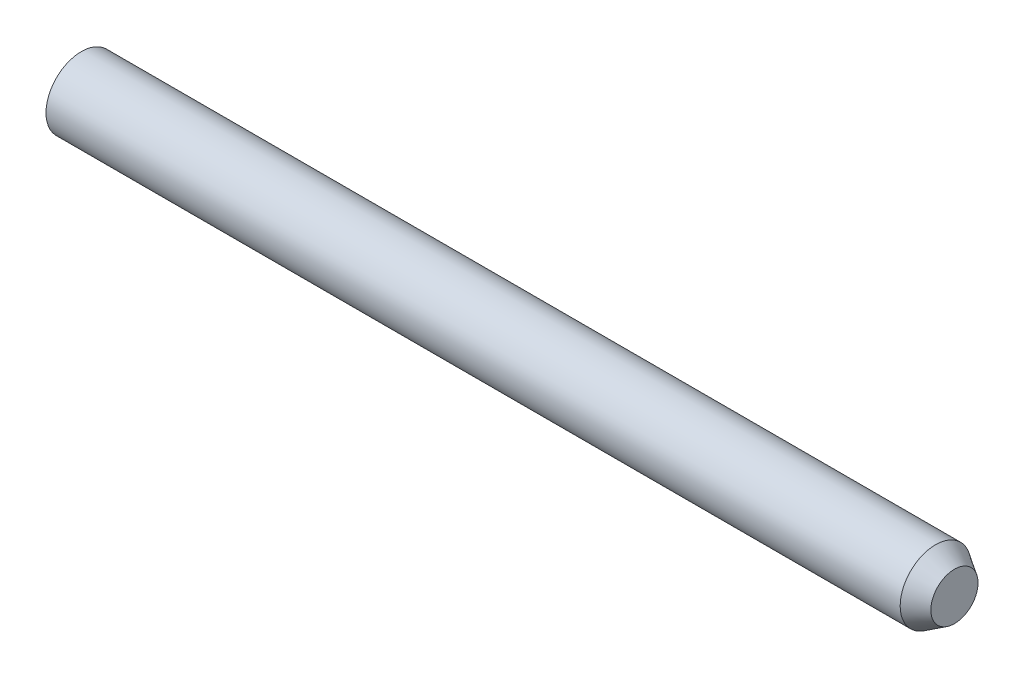
ISO-10303-21;
HEADER;
FILE_DESCRIPTION(('STEP AP214'),'2;1');
FILE_NAME('part.step','',(''),(''),'','','');
FILE_SCHEMA(('AUTOMOTIVE_DESIGN { 1 0 10303 214 1 1 1 1 }'));
ENDSEC;
DATA;
#1=APPLICATION_CONTEXT('core data for automotive mechanical design processes');
#2=APPLICATION_PROTOCOL_DEFINITION('international standard','automotive_design',2000,#1);
#3=PRODUCT_CONTEXT('',#1,'mechanical');
#4=PRODUCT('Part','Part','',(#3));
#5=PRODUCT_RELATED_PRODUCT_CATEGORY('part','',(#4));
#6=PRODUCT_DEFINITION_FORMATION('','',#4);
#7=PRODUCT_DEFINITION_CONTEXT('part definition',#1,'design');
#8=PRODUCT_DEFINITION('design','',#6,#7);
#9=PRODUCT_DEFINITION_SHAPE('','',#8);
#10=(LENGTH_UNIT() NAMED_UNIT(*) SI_UNIT(.MILLI.,.METRE.));
#11=(NAMED_UNIT(*) PLANE_ANGLE_UNIT() SI_UNIT($,.RADIAN.));
#12=(NAMED_UNIT(*) SI_UNIT($,.STERADIAN.) SOLID_ANGLE_UNIT());
#13=UNCERTAINTY_MEASURE_WITH_UNIT(LENGTH_MEASURE(1.E-05),#10,'distance_accuracy_value','');
#14=(GEOMETRIC_REPRESENTATION_CONTEXT(3) GLOBAL_UNCERTAINTY_ASSIGNED_CONTEXT((#13)) GLOBAL_UNIT_ASSIGNED_CONTEXT((#10,
#11,#12)) REPRESENTATION_CONTEXT('',''));
#15=CARTESIAN_POINT('',(0.,0.,0.));
#16=DIRECTION('',(0.,0.,1.));
#17=DIRECTION('',(1.,0.,0.));
#18=AXIS2_PLACEMENT_3D('',#15,#16,#17);
#19=CARTESIAN_POINT('',(-65.,0.,0.));
#20=DIRECTION('',(-1.,0.,0.));
#21=DIRECTION('',(0.,0.,1.));
#22=AXIS2_PLACEMENT_3D('',#19,#20,#21);
#23=CYLINDRICAL_SURFACE('',#22,10.);
#24=CARTESIAN_POINT('',(293.55387657696,0.,0.));
#25=DIRECTION('',(-1.,0.,0.));
#26=DIRECTION('',(0.,0.,1.));
#27=AXIS2_PLACEMENT_3D('',#24,#25,#26);
#28=CIRCLE('',#27,10.);
#29=CARTESIAN_POINT('',(293.55387657696,0.,10.));
#30=VERTEX_POINT('',#29);
#31=EDGE_CURVE('E55',#30,#30,#28,.T.);
#32=ORIENTED_EDGE('',*,*,#31,.F.);
#33=EDGE_LOOP('',(#32));
#34=FACE_BOUND('',#33,.T.);
#35=CARTESIAN_POINT('',(-65.,0.,0.));
#36=DIRECTION('',(-1.,0.,0.));
#37=DIRECTION('',(0.,0.,1.));
#38=AXIS2_PLACEMENT_3D('',#35,#36,#37);
#39=CIRCLE('',#38,10.);
#40=CARTESIAN_POINT('',(-65.,0.,10.));
#41=VERTEX_POINT('',#40);
#42=EDGE_CURVE('E10',#41,#41,#39,.T.);
#43=ORIENTED_EDGE('',*,*,#42,.T.);
#44=EDGE_LOOP('',(#43));
#45=FACE_BOUND('',#44,.T.);
#46=ADVANCED_FACE('F36',(#34,#45),#23,.F.);
#47=CARTESIAN_POINT('',(-65.,0.,0.));
#48=DIRECTION('',(-1.,0.,0.));
#49=DIRECTION('',(0.,0.,1.));
#50=AXIS2_PLACEMENT_3D('',#47,#48,#49);
#51=PLANE('',#50);
#52=CARTESIAN_POINT('',(-65.,0.,0.));
#53=DIRECTION('',(-1.,0.,0.));
#54=DIRECTION('',(0.,0.,1.));
#55=AXIS2_PLACEMENT_3D('',#52,#53,#54);
#56=CIRCLE('',#55,15.);
#57=CARTESIAN_POINT('',(-65.,0.,15.));
#58=VERTEX_POINT('',#57);
#59=EDGE_CURVE('E42',#58,#58,#56,.T.);
#60=ORIENTED_EDGE('',*,*,#59,.T.);
#61=EDGE_LOOP('',(#60));
#62=FACE_BOUND('',#61,.T.);
#63=ORIENTED_EDGE('',*,*,#42,.F.);
#64=EDGE_LOOP('',(#63));
#65=FACE_BOUND('',#64,.T.);
#66=ADVANCED_FACE('F62',(#62,#65),#51,.T.);
#67=CARTESIAN_POINT('',(-65.,0.,0.));
#68=DIRECTION('',(-1.,0.,0.));
#69=DIRECTION('',(0.,0.,1.));
#70=AXIS2_PLACEMENT_3D('',#67,#68,#69);
#71=CYLINDRICAL_SURFACE('',#70,15.);
#72=CARTESIAN_POINT('',(297.,0.,0.));
#73=DIRECTION('',(-1.,0.,0.));
#74=DIRECTION('',(0.,0.,1.));
#75=AXIS2_PLACEMENT_3D('',#72,#73,#74);
#76=CIRCLE('',#75,15.);
#77=CARTESIAN_POINT('',(297.,0.,15.));
#78=VERTEX_POINT('',#77);
#79=EDGE_CURVE('E46',#78,#78,#76,.T.);
#80=ORIENTED_EDGE('',*,*,#79,.T.);
#81=EDGE_LOOP('',(#80));
#82=FACE_BOUND('',#81,.T.);
#83=ORIENTED_EDGE('',*,*,#59,.F.);
#84=EDGE_LOOP('',(#83));
#85=FACE_BOUND('',#84,.T.);
#86=ADVANCED_FACE('F66',(#82,#85),#71,.T.);
#87=CARTESIAN_POINT('',(297.,0.,0.));
#88=DIRECTION('',(-1.,0.,0.));
#89=DIRECTION('',(0.,0.,1.));
#90=AXIS2_PLACEMENT_3D('',#87,#88,#89);
#91=CONICAL_SURFACE('',#90,15.,0.558599315343562);
#92=CARTESIAN_POINT('',(305.,0.,0.));
#93=DIRECTION('',(-1.,0.,0.));
#94=DIRECTION('',(0.,0.,1.));
#95=AXIS2_PLACEMENT_3D('',#92,#93,#94);
#96=CIRCLE('',#95,10.);
#97=CARTESIAN_POINT('',(305.,0.,10.));
#98=VERTEX_POINT('',#97);
#99=EDGE_CURVE('E50',#98,#98,#96,.T.);
#100=ORIENTED_EDGE('',*,*,#99,.T.);
#101=EDGE_LOOP('',(#100));
#102=FACE_BOUND('',#101,.T.);
#103=ORIENTED_EDGE('',*,*,#79,.F.);
#104=EDGE_LOOP('',(#103));
#105=FACE_BOUND('',#104,.T.);
#106=ADVANCED_FACE('F70',(#102,#105),#91,.T.);
#107=CARTESIAN_POINT('',(305.,0.,0.));
#108=DIRECTION('',(1.,0.,0.));
#109=DIRECTION('',(0.,0.,-1.));
#110=AXIS2_PLACEMENT_3D('',#107,#108,#109);
#111=PLANE('',#110);
#112=ORIENTED_EDGE('',*,*,#99,.F.);
#113=EDGE_LOOP('',(#112));
#114=FACE_BOUND('',#113,.T.);
#115=ADVANCED_FACE('F77',(#114),#111,.T.);
#116=CARTESIAN_POINT('',(293.55387657696,0.,0.));
#117=DIRECTION('',(1.,0.,0.));
#118=DIRECTION('',(0.,0.,-1.));
#119=AXIS2_PLACEMENT_3D('',#116,#117,#118);
#120=PLANE('',#119);
#121=ORIENTED_EDGE('',*,*,#31,.T.);
#122=EDGE_LOOP('',(#121));
#123=FACE_BOUND('',#122,.T.);
#124=ADVANCED_FACE('F59',(#123),#120,.F.);
#125=CLOSED_SHELL('',(#46,#66,#86,#106,#115,#124));
#126=MANIFOLD_SOLID_BREP('B2',#125);
#127=ADVANCED_BREP_SHAPE_REPRESENTATION('',(#18,#126),#14);
#128=SHAPE_DEFINITION_REPRESENTATION(#9,#127);
ENDSEC;
END-ISO-10303-21;
